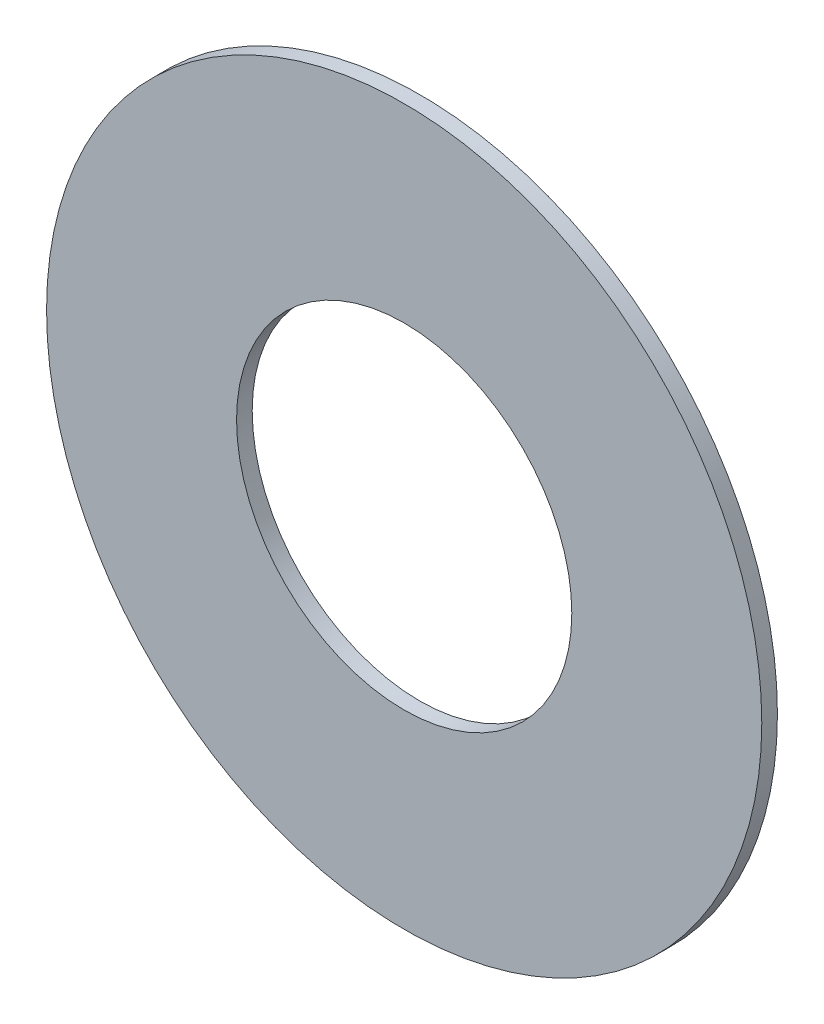
ISO-10303-21;
HEADER;
FILE_DESCRIPTION(('STEP AP214'),'2;1');
FILE_NAME('part.step','',(''),(''),'','','');
FILE_SCHEMA(('AUTOMOTIVE_DESIGN { 1 0 10303 214 1 1 1 1 }'));
ENDSEC;
DATA;
#1=APPLICATION_CONTEXT('core data for automotive mechanical design processes');
#2=APPLICATION_PROTOCOL_DEFINITION('international standard','automotive_design',2000,#1);
#3=PRODUCT_CONTEXT('',#1,'mechanical');
#4=PRODUCT('Part','Part','',(#3));
#5=PRODUCT_RELATED_PRODUCT_CATEGORY('part','',(#4));
#6=PRODUCT_DEFINITION_FORMATION('','',#4);
#7=PRODUCT_DEFINITION_CONTEXT('part definition',#1,'design');
#8=PRODUCT_DEFINITION('design','',#6,#7);
#9=PRODUCT_DEFINITION_SHAPE('','',#8);
#10=(LENGTH_UNIT() NAMED_UNIT(*) SI_UNIT(.MILLI.,.METRE.));
#11=(NAMED_UNIT(*) PLANE_ANGLE_UNIT() SI_UNIT($,.RADIAN.));
#12=(NAMED_UNIT(*) SI_UNIT($,.STERADIAN.) SOLID_ANGLE_UNIT());
#13=UNCERTAINTY_MEASURE_WITH_UNIT(LENGTH_MEASURE(1.E-05),#10,'distance_accuracy_value','');
#14=(GEOMETRIC_REPRESENTATION_CONTEXT(3) GLOBAL_UNCERTAINTY_ASSIGNED_CONTEXT((#13)) GLOBAL_UNIT_ASSIGNED_CONTEXT((#10,
#11,#12)) REPRESENTATION_CONTEXT('',''));
#15=CARTESIAN_POINT('',(0.,0.,0.));
#16=DIRECTION('',(0.,0.,1.));
#17=DIRECTION('',(1.,0.,0.));
#18=AXIS2_PLACEMENT_3D('',#15,#16,#17);
#19=CARTESIAN_POINT('',(117.856,-120.396,-0.045));
#20=DIRECTION('',(0.,0.,-1.));
#21=DIRECTION('',(0.,-1.,0.));
#22=AXIS2_PLACEMENT_3D('',#19,#20,#21);
#23=CYLINDRICAL_SURFACE('',#22,0.375);
#24=CARTESIAN_POINT('',(117.856,-120.396,-0.035));
#25=DIRECTION('',(0.,0.,-1.));
#26=DIRECTION('',(0.,-1.,0.));
#27=AXIS2_PLACEMENT_3D('',#24,#25,#26);
#28=CIRCLE('',#27,0.375);
#29=CARTESIAN_POINT('',(117.856,-120.771,-0.035));
#30=VERTEX_POINT('',#29);
#31=EDGE_CURVE('E20',#30,#30,#28,.T.);
#32=ORIENTED_EDGE('',*,*,#31,.T.);
#33=DIRECTION('',(0.,0.,1.));
#34=VECTOR('',#33,1.);
#35=CARTESIAN_POINT('',(117.856,-120.771,-0.045));
#36=LINE('',#35,#34);
#37=CARTESIAN_POINT('',(117.856,-120.771,0.));
#38=VERTEX_POINT('',#37);
#39=EDGE_CURVE('E11',#30,#38,#36,.T.);
#40=ORIENTED_EDGE('',*,*,#39,.T.);
#41=CARTESIAN_POINT('',(117.856,-120.396,0.));
#42=DIRECTION('',(0.,0.,-1.));
#43=DIRECTION('',(0.,-1.,0.));
#44=AXIS2_PLACEMENT_3D('',#41,#42,#43);
#45=CIRCLE('',#44,0.375);
#46=EDGE_CURVE('E69',#38,#38,#45,.T.);
#47=ORIENTED_EDGE('',*,*,#46,.F.);
#48=ORIENTED_EDGE('',*,*,#39,.F.);
#49=EDGE_LOOP('',(#32,#40,#47,#48));
#50=FACE_BOUND('',#49,.T.);
#51=ADVANCED_FACE('F17',(#50),#23,.F.);
#52=CARTESIAN_POINT('',(117.856,-120.396,-0.035));
#53=DIRECTION('',(0.,0.,1.));
#54=DIRECTION('',(1.,0.,0.));
#55=AXIS2_PLACEMENT_3D('',#52,#53,#54);
#56=PLANE('',#55);
#57=ORIENTED_EDGE('',*,*,#31,.F.);
#58=EDGE_LOOP('',(#57));
#59=FACE_BOUND('',#58,.T.);
#60=CARTESIAN_POINT('',(117.856,-120.396,-0.035));
#61=DIRECTION('',(0.,0.,1.));
#62=DIRECTION('',(1.,0.,0.));
#63=AXIS2_PLACEMENT_3D('',#60,#61,#62);
#64=CIRCLE('',#63,0.8);
#65=CARTESIAN_POINT('',(118.656,-120.396,-0.035));
#66=VERTEX_POINT('',#65);
#67=EDGE_CURVE('E57',#66,#66,#64,.T.);
#68=ORIENTED_EDGE('',*,*,#67,.F.);
#69=EDGE_LOOP('',(#68));
#70=FACE_BOUND('',#69,.T.);
#71=ADVANCED_FACE('F79',(#59,#70),#56,.F.);
#72=CARTESIAN_POINT('',(117.856,-120.396,0.));
#73=DIRECTION('',(0.,0.,1.));
#74=DIRECTION('',(1.,0.,0.));
#75=AXIS2_PLACEMENT_3D('',#72,#73,#74);
#76=PLANE('',#75);
#77=ORIENTED_EDGE('',*,*,#46,.T.);
#78=EDGE_LOOP('',(#77));
#79=FACE_BOUND('',#78,.T.);
#80=CARTESIAN_POINT('',(117.856,-120.396,0.));
#81=DIRECTION('',(0.,0.,1.));
#82=DIRECTION('',(1.,0.,0.));
#83=AXIS2_PLACEMENT_3D('',#80,#81,#82);
#84=CIRCLE('',#83,0.8);
#85=CARTESIAN_POINT('',(118.656,-120.396,0.));
#86=VERTEX_POINT('',#85);
#87=EDGE_CURVE('E55',#86,#86,#84,.T.);
#88=ORIENTED_EDGE('',*,*,#87,.T.);
#89=EDGE_LOOP('',(#88));
#90=FACE_BOUND('',#89,.T.);
#91=ADVANCED_FACE('F61',(#79,#90),#76,.T.);
#92=CARTESIAN_POINT('',(117.856,-120.396,-0.035));
#93=DIRECTION('',(0.,0.,1.));
#94=DIRECTION('',(1.,0.,0.));
#95=AXIS2_PLACEMENT_3D('',#92,#93,#94);
#96=CYLINDRICAL_SURFACE('',#95,0.8);
#97=ORIENTED_EDGE('',*,*,#87,.F.);
#98=DIRECTION('',(0.,0.,1.));
#99=VECTOR('',#98,1.);
#100=CARTESIAN_POINT('',(118.656,-120.396,-0.035));
#101=LINE('',#100,#99);
#102=EDGE_CURVE('E52',#66,#86,#101,.T.);
#103=ORIENTED_EDGE('',*,*,#102,.F.);
#104=ORIENTED_EDGE('',*,*,#67,.T.);
#105=ORIENTED_EDGE('',*,*,#102,.T.);
#106=EDGE_LOOP('',(#97,#103,#104,#105));
#107=FACE_BOUND('',#106,.T.);
#108=ADVANCED_FACE('F54',(#107),#96,.T.);
#109=CLOSED_SHELL('',(#51,#71,#91,#108));
#110=MANIFOLD_SOLID_BREP('B1',#109);
#111=ADVANCED_BREP_SHAPE_REPRESENTATION('',(#18,#110),#14);
#112=SHAPE_DEFINITION_REPRESENTATION(#9,#111);
ENDSEC;
END-ISO-10303-21;
